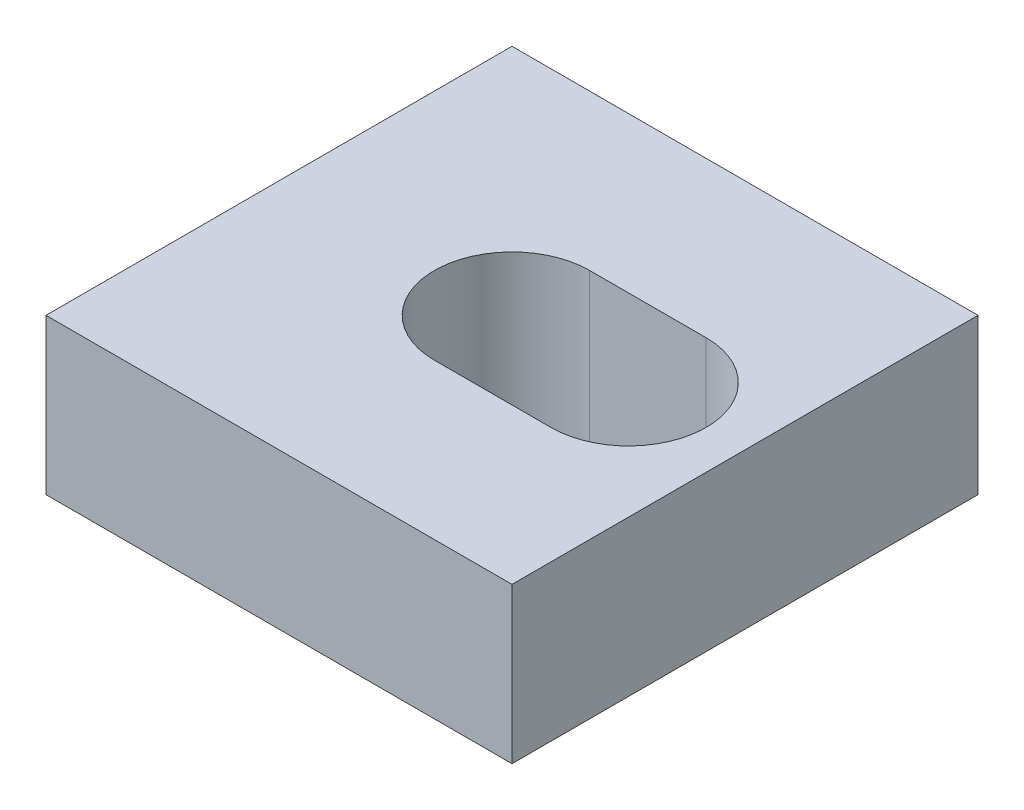
ISO-10303-21;
HEADER;
FILE_DESCRIPTION(('STEP AP214'),'2;1');
FILE_NAME('part.step','',(''),(''),'','','');
FILE_SCHEMA(('AUTOMOTIVE_DESIGN { 1 0 10303 214 1 1 1 1 }'));
ENDSEC;
DATA;
#1=APPLICATION_CONTEXT('core data for automotive mechanical design processes');
#2=APPLICATION_PROTOCOL_DEFINITION('international standard','automotive_design',2000,#1);
#3=PRODUCT_CONTEXT('',#1,'mechanical');
#4=PRODUCT('Part','Part','',(#3));
#5=PRODUCT_RELATED_PRODUCT_CATEGORY('part','',(#4));
#6=PRODUCT_DEFINITION_FORMATION('','',#4);
#7=PRODUCT_DEFINITION_CONTEXT('part definition',#1,'design');
#8=PRODUCT_DEFINITION('design','',#6,#7);
#9=PRODUCT_DEFINITION_SHAPE('','',#8);
#10=(LENGTH_UNIT() NAMED_UNIT(*) SI_UNIT(.MILLI.,.METRE.));
#11=(NAMED_UNIT(*) PLANE_ANGLE_UNIT() SI_UNIT($,.RADIAN.));
#12=(NAMED_UNIT(*) SI_UNIT($,.STERADIAN.) SOLID_ANGLE_UNIT());
#13=UNCERTAINTY_MEASURE_WITH_UNIT(LENGTH_MEASURE(1.E-05),#10,'distance_accuracy_value','');
#14=(GEOMETRIC_REPRESENTATION_CONTEXT(3) GLOBAL_UNCERTAINTY_ASSIGNED_CONTEXT((#13)) GLOBAL_UNIT_ASSIGNED_CONTEXT((#10,
#11,#12)) REPRESENTATION_CONTEXT('',''));
#15=CARTESIAN_POINT('',(0.,0.,0.));
#16=DIRECTION('',(0.,0.,1.));
#17=DIRECTION('',(1.,0.,0.));
#18=AXIS2_PLACEMENT_3D('',#15,#16,#17);
#19=CARTESIAN_POINT('',(0.,20.,0.));
#20=DIRECTION('',(0.,1.,0.));
#21=DIRECTION('',(0.,0.,1.));
#22=AXIS2_PLACEMENT_3D('',#19,#20,#21);
#23=PLANE('',#22);
#24=CARTESIAN_POINT('',(0.,20.,0.));
#25=DIRECTION('',(0.,1.,0.));
#26=DIRECTION('',(0.,0.,1.));
#27=AXIS2_PLACEMENT_3D('',#24,#25,#26);
#28=CIRCLE('',#27,10.);
#29=CARTESIAN_POINT('',(0.,20.,10.));
#30=VERTEX_POINT('',#29);
#31=CARTESIAN_POINT('',(0.,20.,-10.));
#32=VERTEX_POINT('',#31);
#33=EDGE_CURVE('E120',#30,#32,#28,.F.);
#34=ORIENTED_EDGE('',*,*,#33,.T.);
#35=DIRECTION('',(1.,0.,0.));
#36=VECTOR('',#35,1.);
#37=CARTESIAN_POINT('',(0.,20.,-10.));
#38=LINE('',#37,#36);
#39=CARTESIAN_POINT('',(15.,20.,-10.));
#40=VERTEX_POINT('',#39);
#41=EDGE_CURVE('E61',#40,#32,#38,.F.);
#42=ORIENTED_EDGE('',*,*,#41,.F.);
#43=CARTESIAN_POINT('',(15.,20.,0.));
#44=DIRECTION('',(0.,1.,0.));
#45=DIRECTION('',(0.,0.,1.));
#46=AXIS2_PLACEMENT_3D('',#43,#44,#45);
#47=CIRCLE('',#46,10.);
#48=CARTESIAN_POINT('',(15.,20.,10.));
#49=VERTEX_POINT('',#48);
#50=EDGE_CURVE('E20',#40,#49,#47,.F.);
#51=ORIENTED_EDGE('',*,*,#50,.T.);
#52=DIRECTION('',(-1.,0.,0.));
#53=VECTOR('',#52,1.);
#54=CARTESIAN_POINT('',(15.,20.,10.));
#55=LINE('',#54,#53);
#56=EDGE_CURVE('E114',#30,#49,#55,.F.);
#57=ORIENTED_EDGE('',*,*,#56,.F.);
#58=EDGE_LOOP('',(#34,#42,#51,#57));
#59=FACE_BOUND('',#58,.T.);
#60=DIRECTION('',(-1.,0.,0.));
#61=VECTOR('',#60,1.);
#62=CARTESIAN_POINT('',(30.,20.,-30.));
#63=LINE('',#62,#61);
#64=CARTESIAN_POINT('',(-30.,20.,-30.));
#65=VERTEX_POINT('',#64);
#66=CARTESIAN_POINT('',(30.,20.,-30.));
#67=VERTEX_POINT('',#66);
#68=EDGE_CURVE('E71',#65,#67,#63,.F.);
#69=ORIENTED_EDGE('',*,*,#68,.F.);
#70=DIRECTION('',(0.,0.,1.));
#71=VECTOR('',#70,1.);
#72=CARTESIAN_POINT('',(-30.,20.,-30.));
#73=LINE('',#72,#71);
#74=CARTESIAN_POINT('',(-30.,20.,30.));
#75=VERTEX_POINT('',#74);
#76=EDGE_CURVE('E98',#75,#65,#73,.F.);
#77=ORIENTED_EDGE('',*,*,#76,.F.);
#78=DIRECTION('',(1.,0.,0.));
#79=VECTOR('',#78,1.);
#80=CARTESIAN_POINT('',(-30.,20.,30.));
#81=LINE('',#80,#79);
#82=CARTESIAN_POINT('',(30.,20.,30.));
#83=VERTEX_POINT('',#82);
#84=EDGE_CURVE('E89',#83,#75,#81,.F.);
#85=ORIENTED_EDGE('',*,*,#84,.F.);
#86=DIRECTION('',(0.,0.,-1.));
#87=VECTOR('',#86,1.);
#88=CARTESIAN_POINT('',(30.,20.,30.));
#89=LINE('',#88,#87);
#90=EDGE_CURVE('E83',#67,#83,#89,.F.);
#91=ORIENTED_EDGE('',*,*,#90,.F.);
#92=EDGE_LOOP('',(#69,#77,#85,#91));
#93=FACE_BOUND('',#92,.T.);
#94=ADVANCED_FACE('F17',(#59,#93),#23,.T.);
#95=CARTESIAN_POINT('',(-30.,0.,-30.));
#96=DIRECTION('',(-1.,0.,0.));
#97=DIRECTION('',(0.,0.,1.));
#98=AXIS2_PLACEMENT_3D('',#95,#96,#97);
#99=PLANE('',#98);
#100=DIRECTION('',(0.,1.,0.));
#101=VECTOR('',#100,1.);
#102=CARTESIAN_POINT('',(-30.,0.,-30.));
#103=LINE('',#102,#101);
#104=CARTESIAN_POINT('',(-30.,0.,-30.));
#105=VERTEX_POINT('',#104);
#106=EDGE_CURVE('E134',#105,#65,#103,.T.);
#107=ORIENTED_EDGE('',*,*,#106,.F.);
#108=DIRECTION('',(0.,0.,1.));
#109=VECTOR('',#108,1.);
#110=CARTESIAN_POINT('',(-30.,0.,0.));
#111=LINE('',#110,#109);
#112=CARTESIAN_POINT('',(-30.,0.,30.));
#113=VERTEX_POINT('',#112);
#114=EDGE_CURVE('E106',#105,#113,#111,.T.);
#115=ORIENTED_EDGE('',*,*,#114,.T.);
#116=DIRECTION('',(0.,1.,0.));
#117=VECTOR('',#116,1.);
#118=CARTESIAN_POINT('',(-30.,0.,30.));
#119=LINE('',#118,#117);
#120=EDGE_CURVE('E94',#75,#113,#119,.F.);
#121=ORIENTED_EDGE('',*,*,#120,.F.);
#122=ORIENTED_EDGE('',*,*,#76,.T.);
#123=EDGE_LOOP('',(#107,#115,#121,#122));
#124=FACE_BOUND('',#123,.T.);
#125=ADVANCED_FACE('F104',(#124),#99,.T.);
#126=CARTESIAN_POINT('',(-30.,0.,30.));
#127=DIRECTION('',(0.,0.,1.));
#128=DIRECTION('',(1.,0.,0.));
#129=AXIS2_PLACEMENT_3D('',#126,#127,#128);
#130=PLANE('',#129);
#131=ORIENTED_EDGE('',*,*,#120,.T.);
#132=DIRECTION('',(1.,0.,0.));
#133=VECTOR('',#132,1.);
#134=CARTESIAN_POINT('',(0.,0.,30.));
#135=LINE('',#134,#133);
#136=CARTESIAN_POINT('',(30.,0.,30.));
#137=VERTEX_POINT('',#136);
#138=EDGE_CURVE('E144',#113,#137,#135,.T.);
#139=ORIENTED_EDGE('',*,*,#138,.T.);
#140=DIRECTION('',(0.,1.,0.));
#141=VECTOR('',#140,1.);
#142=CARTESIAN_POINT('',(30.,0.,30.));
#143=LINE('',#142,#141);
#144=EDGE_CURVE('E96',#83,#137,#143,.F.);
#145=ORIENTED_EDGE('',*,*,#144,.F.);
#146=ORIENTED_EDGE('',*,*,#84,.T.);
#147=EDGE_LOOP('',(#131,#139,#145,#146));
#148=FACE_BOUND('',#147,.T.);
#149=ADVANCED_FACE('F91',(#148),#130,.T.);
#150=CARTESIAN_POINT('',(30.,0.,30.));
#151=DIRECTION('',(1.,0.,0.));
#152=DIRECTION('',(0.,0.,-1.));
#153=AXIS2_PLACEMENT_3D('',#150,#151,#152);
#154=PLANE('',#153);
#155=ORIENTED_EDGE('',*,*,#144,.T.);
#156=DIRECTION('',(0.,0.,1.));
#157=VECTOR('',#156,1.);
#158=CARTESIAN_POINT('',(30.,0.,0.));
#159=LINE('',#158,#157);
#160=CARTESIAN_POINT('',(30.,0.,-30.));
#161=VERTEX_POINT('',#160);
#162=EDGE_CURVE('E139',#137,#161,#159,.F.);
#163=ORIENTED_EDGE('',*,*,#162,.T.);
#164=DIRECTION('',(0.,1.,0.));
#165=VECTOR('',#164,1.);
#166=CARTESIAN_POINT('',(30.,0.,-30.));
#167=LINE('',#166,#165);
#168=EDGE_CURVE('E113',#67,#161,#167,.F.);
#169=ORIENTED_EDGE('',*,*,#168,.F.);
#170=ORIENTED_EDGE('',*,*,#90,.T.);
#171=EDGE_LOOP('',(#155,#163,#169,#170));
#172=FACE_BOUND('',#171,.T.);
#173=ADVANCED_FACE('F138',(#172),#154,.T.);
#174=CARTESIAN_POINT('',(30.,0.,-30.));
#175=DIRECTION('',(0.,0.,-1.));
#176=DIRECTION('',(-1.,0.,0.));
#177=AXIS2_PLACEMENT_3D('',#174,#175,#176);
#178=PLANE('',#177);
#179=ORIENTED_EDGE('',*,*,#168,.T.);
#180=DIRECTION('',(1.,0.,0.));
#181=VECTOR('',#180,1.);
#182=CARTESIAN_POINT('',(0.,0.,-30.));
#183=LINE('',#182,#181);
#184=EDGE_CURVE('E146',#161,#105,#183,.F.);
#185=ORIENTED_EDGE('',*,*,#184,.T.);
#186=ORIENTED_EDGE('',*,*,#106,.T.);
#187=ORIENTED_EDGE('',*,*,#68,.T.);
#188=EDGE_LOOP('',(#179,#185,#186,#187));
#189=FACE_BOUND('',#188,.T.);
#190=ADVANCED_FACE('F178',(#189),#178,.T.);
#191=CARTESIAN_POINT('',(0.,0.,-10.));
#192=DIRECTION('',(0.,0.,1.));
#193=DIRECTION('',(1.,0.,0.));
#194=AXIS2_PLACEMENT_3D('',#191,#192,#193);
#195=PLANE('',#194);
#196=DIRECTION('',(0.,1.,0.));
#197=VECTOR('',#196,1.);
#198=CARTESIAN_POINT('',(0.,0.,-10.));
#199=LINE('',#198,#197);
#200=CARTESIAN_POINT('',(0.,0.,-10.));
#201=VERTEX_POINT('',#200);
#202=EDGE_CURVE('E121',#32,#201,#199,.F.);
#203=ORIENTED_EDGE('',*,*,#202,.T.);
#204=DIRECTION('',(1.,0.,0.));
#205=VECTOR('',#204,1.);
#206=CARTESIAN_POINT('',(0.,0.,-10.));
#207=LINE('',#206,#205);
#208=CARTESIAN_POINT('',(15.,0.,-10.));
#209=VERTEX_POINT('',#208);
#210=EDGE_CURVE('E119',#201,#209,#207,.T.);
#211=ORIENTED_EDGE('',*,*,#210,.T.);
#212=DIRECTION('',(0.,1.,0.));
#213=VECTOR('',#212,1.);
#214=CARTESIAN_POINT('',(15.,0.,-10.));
#215=LINE('',#214,#213);
#216=EDGE_CURVE('E112',#209,#40,#215,.T.);
#217=ORIENTED_EDGE('',*,*,#216,.T.);
#218=ORIENTED_EDGE('',*,*,#41,.T.);
#219=EDGE_LOOP('',(#203,#211,#217,#218));
#220=FACE_BOUND('',#219,.T.);
#221=ADVANCED_FACE('F161',(#220),#195,.T.);
#222=CARTESIAN_POINT('',(15.,0.,0.));
#223=DIRECTION('',(0.,1.,0.));
#224=DIRECTION('',(0.,0.,1.));
#225=AXIS2_PLACEMENT_3D('',#222,#223,#224);
#226=CYLINDRICAL_SURFACE('',#225,10.);
#227=ORIENTED_EDGE('',*,*,#50,.F.);
#228=ORIENTED_EDGE('',*,*,#216,.F.);
#229=CARTESIAN_POINT('',(15.,0.,0.));
#230=DIRECTION('',(0.,1.,0.));
#231=DIRECTION('',(0.,0.,1.));
#232=AXIS2_PLACEMENT_3D('',#229,#230,#231);
#233=CIRCLE('',#232,10.);
#234=CARTESIAN_POINT('',(15.,0.,10.));
#235=VERTEX_POINT('',#234);
#236=EDGE_CURVE('E117',#209,#235,#233,.F.);
#237=ORIENTED_EDGE('',*,*,#236,.T.);
#238=DIRECTION('',(0.,1.,0.));
#239=VECTOR('',#238,1.);
#240=CARTESIAN_POINT('',(15.,0.,10.));
#241=LINE('',#240,#239);
#242=EDGE_CURVE('E115',#49,#235,#241,.F.);
#243=ORIENTED_EDGE('',*,*,#242,.F.);
#244=EDGE_LOOP('',(#227,#228,#237,#243));
#245=FACE_BOUND('',#244,.T.);
#246=ADVANCED_FACE('F159',(#245),#226,.F.);
#247=CARTESIAN_POINT('',(15.,0.,10.));
#248=DIRECTION('',(0.,0.,-1.));
#249=DIRECTION('',(-1.,0.,0.));
#250=AXIS2_PLACEMENT_3D('',#247,#248,#249);
#251=PLANE('',#250);
#252=ORIENTED_EDGE('',*,*,#242,.T.);
#253=DIRECTION('',(1.,0.,0.));
#254=VECTOR('',#253,1.);
#255=CARTESIAN_POINT('',(0.,0.,10.));
#256=LINE('',#255,#254);
#257=CARTESIAN_POINT('',(0.,0.,10.));
#258=VERTEX_POINT('',#257);
#259=EDGE_CURVE('E26',#235,#258,#256,.F.);
#260=ORIENTED_EDGE('',*,*,#259,.T.);
#261=DIRECTION('',(0.,1.,0.));
#262=VECTOR('',#261,1.);
#263=CARTESIAN_POINT('',(0.,0.,10.));
#264=LINE('',#263,#262);
#265=EDGE_CURVE('E34',#258,#30,#264,.T.);
#266=ORIENTED_EDGE('',*,*,#265,.T.);
#267=ORIENTED_EDGE('',*,*,#56,.T.);
#268=EDGE_LOOP('',(#252,#260,#266,#267));
#269=FACE_BOUND('',#268,.T.);
#270=ADVANCED_FACE('F154',(#269),#251,.T.);
#271=CARTESIAN_POINT('',(0.,0.,0.));
#272=DIRECTION('',(0.,1.,0.));
#273=DIRECTION('',(0.,0.,1.));
#274=AXIS2_PLACEMENT_3D('',#271,#272,#273);
#275=CYLINDRICAL_SURFACE('',#274,10.);
#276=ORIENTED_EDGE('',*,*,#33,.F.);
#277=ORIENTED_EDGE('',*,*,#265,.F.);
#278=CARTESIAN_POINT('',(0.,0.,0.));
#279=DIRECTION('',(0.,1.,0.));
#280=DIRECTION('',(0.,0.,1.));
#281=AXIS2_PLACEMENT_3D('',#278,#279,#280);
#282=CIRCLE('',#281,10.);
#283=EDGE_CURVE('E11',#258,#201,#282,.F.);
#284=ORIENTED_EDGE('',*,*,#283,.T.);
#285=ORIENTED_EDGE('',*,*,#202,.F.);
#286=EDGE_LOOP('',(#276,#277,#284,#285));
#287=FACE_BOUND('',#286,.T.);
#288=ADVANCED_FACE('F163',(#287),#275,.F.);
#289=CARTESIAN_POINT('',(0.,0.,0.));
#290=DIRECTION('',(0.,1.,0.));
#291=DIRECTION('',(0.,0.,1.));
#292=AXIS2_PLACEMENT_3D('',#289,#290,#291);
#293=PLANE('',#292);
#294=ORIENTED_EDGE('',*,*,#259,.F.);
#295=ORIENTED_EDGE('',*,*,#236,.F.);
#296=ORIENTED_EDGE('',*,*,#210,.F.);
#297=ORIENTED_EDGE('',*,*,#283,.F.);
#298=EDGE_LOOP('',(#294,#295,#296,#297));
#299=FACE_BOUND('',#298,.T.);
#300=ORIENTED_EDGE('',*,*,#162,.F.);
#301=ORIENTED_EDGE('',*,*,#138,.F.);
#302=ORIENTED_EDGE('',*,*,#114,.F.);
#303=ORIENTED_EDGE('',*,*,#184,.F.);
#304=EDGE_LOOP('',(#300,#301,#302,#303));
#305=FACE_BOUND('',#304,.T.);
#306=ADVANCED_FACE('F143',(#299,#305),#293,.F.);
#307=CLOSED_SHELL('',(#94,#125,#149,#173,#190,#221,#246,#270,#288,#306));
#308=MANIFOLD_SOLID_BREP('B1',#307);
#309=ADVANCED_BREP_SHAPE_REPRESENTATION('',(#18,#308),#14);
#310=SHAPE_DEFINITION_REPRESENTATION(#9,#309);
ENDSEC;
END-ISO-10303-21;
